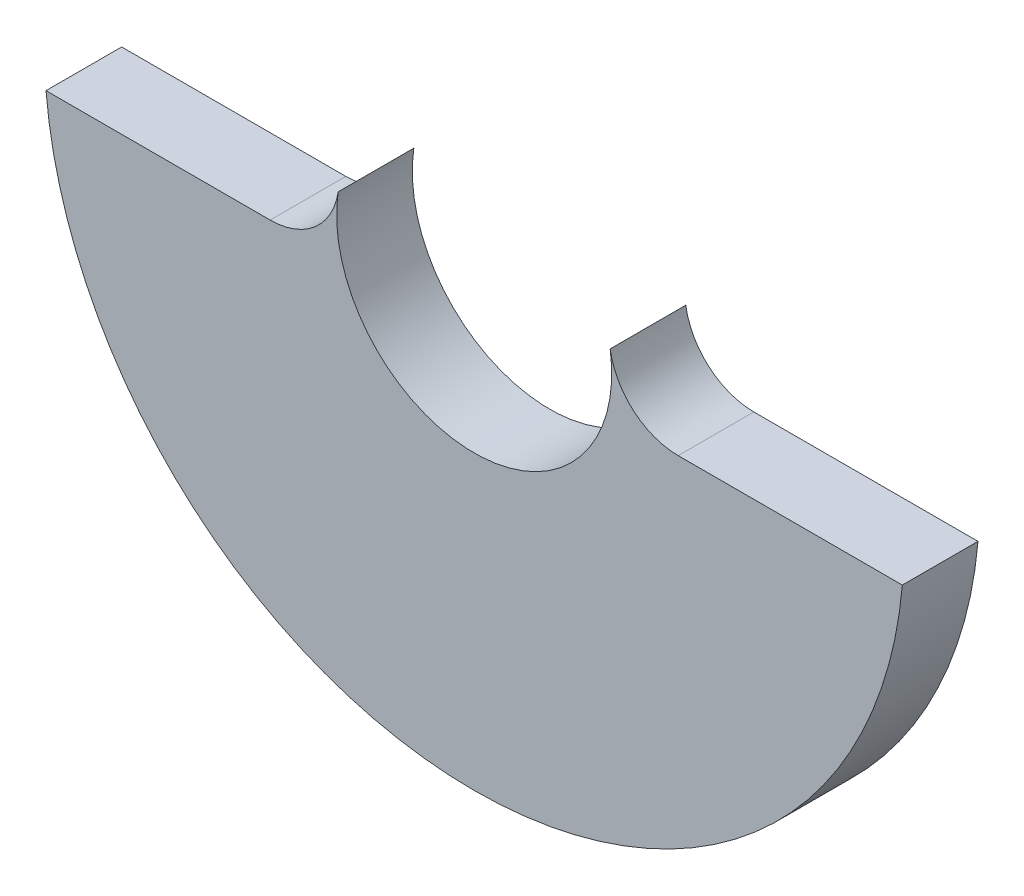
ISO-10303-21;
HEADER;
FILE_DESCRIPTION(('STEP AP214'),'2;1');
FILE_NAME('part.step','',(''),(''),'','','');
FILE_SCHEMA(('AUTOMOTIVE_DESIGN { 1 0 10303 214 1 1 1 1 }'));
ENDSEC;
DATA;
#1=APPLICATION_CONTEXT('core data for automotive mechanical design processes');
#2=APPLICATION_PROTOCOL_DEFINITION('international standard','automotive_design',2000,#1);
#3=PRODUCT_CONTEXT('',#1,'mechanical');
#4=PRODUCT('Part','Part','',(#3));
#5=PRODUCT_RELATED_PRODUCT_CATEGORY('part','',(#4));
#6=PRODUCT_DEFINITION_FORMATION('','',#4);
#7=PRODUCT_DEFINITION_CONTEXT('part definition',#1,'design');
#8=PRODUCT_DEFINITION('design','',#6,#7);
#9=PRODUCT_DEFINITION_SHAPE('','',#8);
#10=(LENGTH_UNIT() NAMED_UNIT(*) SI_UNIT(.MILLI.,.METRE.));
#11=(NAMED_UNIT(*) PLANE_ANGLE_UNIT() SI_UNIT($,.RADIAN.));
#12=(NAMED_UNIT(*) SI_UNIT($,.STERADIAN.) SOLID_ANGLE_UNIT());
#13=UNCERTAINTY_MEASURE_WITH_UNIT(LENGTH_MEASURE(1.E-05),#10,'distance_accuracy_value','');
#14=(GEOMETRIC_REPRESENTATION_CONTEXT(3) GLOBAL_UNCERTAINTY_ASSIGNED_CONTEXT((#13)) GLOBAL_UNIT_ASSIGNED_CONTEXT((#10,
#11,#12)) REPRESENTATION_CONTEXT('',''));
#15=CARTESIAN_POINT('',(0.,0.,0.));
#16=DIRECTION('',(0.,0.,1.));
#17=DIRECTION('',(1.,0.,0.));
#18=AXIS2_PLACEMENT_3D('',#15,#16,#17);
#19=CARTESIAN_POINT('',(-31.283198072784,-2.2,0.));
#20=DIRECTION('',(0.,-1.,0.));
#21=DIRECTION('',(0.,0.,-1.));
#22=AXIS2_PLACEMENT_3D('',#19,#20,#21);
#23=PLANE('',#22);
#24=DIRECTION('',(0.,0.,1.));
#25=VECTOR('',#24,1.);
#26=CARTESIAN_POINT('',(11.8642319599711,-2.2,0.));
#27=LINE('',#26,#25);
#28=CARTESIAN_POINT('',(11.8642319599711,-2.2,0.));
#29=VERTEX_POINT('',#28);
#30=CARTESIAN_POINT('',(11.8642319599711,-2.2,4.4));
#31=VERTEX_POINT('',#30);
#32=EDGE_CURVE('E84',#29,#31,#27,.T.);
#33=ORIENTED_EDGE('',*,*,#32,.T.);
#34=DIRECTION('',(1.,0.,0.));
#35=VECTOR('',#34,1.);
#36=CARTESIAN_POINT('',(-31.283198072784,-2.2,4.4));
#37=LINE('',#36,#35);
#38=CARTESIAN_POINT('',(24.9030118660374,-2.2,4.4));
#39=VERTEX_POINT('',#38);
#40=EDGE_CURVE('E75',#31,#39,#37,.T.);
#41=ORIENTED_EDGE('',*,*,#40,.T.);
#42=DIRECTION('',(0.,0.,-1.));
#43=VECTOR('',#42,1.);
#44=CARTESIAN_POINT('',(24.9030118660374,-2.2,4.4));
#45=LINE('',#44,#43);
#46=CARTESIAN_POINT('',(24.9030118660374,-2.2,0.));
#47=VERTEX_POINT('',#46);
#48=EDGE_CURVE('E110',#47,#39,#45,.F.);
#49=ORIENTED_EDGE('',*,*,#48,.F.);
#50=DIRECTION('',(1.,0.,0.));
#51=VECTOR('',#50,1.);
#52=CARTESIAN_POINT('',(-31.283198072784,-2.2,0.));
#53=LINE('',#52,#51);
#54=EDGE_CURVE('E37',#29,#47,#53,.T.);
#55=ORIENTED_EDGE('',*,*,#54,.F.);
#56=EDGE_LOOP('',(#33,#41,#49,#55));
#57=FACE_BOUND('',#56,.T.);
#58=ADVANCED_FACE('F22',(#57),#23,.F.);
#59=CARTESIAN_POINT('',(0.,0.,4.4));
#60=DIRECTION('',(0.,0.,1.));
#61=DIRECTION('',(1.,0.,0.));
#62=AXIS2_PLACEMENT_3D('',#59,#60,#61);
#63=PLANE('',#62);
#64=CARTESIAN_POINT('',(-24.9030118660374,-2.2,4.4));
#65=VERTEX_POINT('',#64);
#66=CARTESIAN_POINT('',(-11.8642319599711,-2.2,4.4));
#67=VERTEX_POINT('',#66);
#68=EDGE_CURVE('E82',#65,#67,#37,.T.);
#69=ORIENTED_EDGE('',*,*,#68,.F.);
#70=CARTESIAN_POINT('',(0.,0.,4.4));
#71=DIRECTION('',(0.,0.,1.));
#72=DIRECTION('',(1.,0.,0.));
#73=AXIS2_PLACEMENT_3D('',#70,#71,#72);
#74=CIRCLE('',#73,25.);
#75=EDGE_CURVE('E11',#65,#39,#74,.T.);
#76=ORIENTED_EDGE('',*,*,#75,.T.);
#77=ORIENTED_EDGE('',*,*,#40,.F.);
#78=CARTESIAN_POINT('',(11.8642319599711,1.8,4.4));
#79=DIRECTION('',(0.,0.,-1.));
#80=DIRECTION('',(1.,0.,0.));
#81=AXIS2_PLACEMENT_3D('',#78,#79,#80);
#82=CIRCLE('',#81,4.);
#83=CARTESIAN_POINT('',(7.90948797331408,1.2,4.4));
#84=VERTEX_POINT('',#83);
#85=EDGE_CURVE('E79',#31,#84,#82,.T.);
#86=ORIENTED_EDGE('',*,*,#85,.T.);
#87=CARTESIAN_POINT('',(0.,0.,4.4));
#88=DIRECTION('',(0.,0.,1.));
#89=DIRECTION('',(1.,0.,0.));
#90=AXIS2_PLACEMENT_3D('',#87,#88,#89);
#91=CIRCLE('',#90,8.);
#92=CARTESIAN_POINT('',(-7.90948797331408,1.2,4.4));
#93=VERTEX_POINT('',#92);
#94=EDGE_CURVE('E117',#93,#84,#91,.T.);
#95=ORIENTED_EDGE('',*,*,#94,.F.);
#96=CARTESIAN_POINT('',(-11.8642319599711,1.8,4.4));
#97=DIRECTION('',(0.,0.,-1.));
#98=DIRECTION('',(1.,0.,0.));
#99=AXIS2_PLACEMENT_3D('',#96,#97,#98);
#100=CIRCLE('',#99,4.);
#101=EDGE_CURVE('E97',#93,#67,#100,.T.);
#102=ORIENTED_EDGE('',*,*,#101,.T.);
#103=EDGE_LOOP('',(#69,#76,#77,#86,#95,#102));
#104=FACE_BOUND('',#103,.T.);
#105=ADVANCED_FACE('F77',(#104),#63,.T.);
#106=CARTESIAN_POINT('',(0.,0.,0.));
#107=DIRECTION('',(0.,0.,1.));
#108=DIRECTION('',(1.,0.,0.));
#109=AXIS2_PLACEMENT_3D('',#106,#107,#108);
#110=PLANE('',#109);
#111=CARTESIAN_POINT('',(0.,0.,0.));
#112=DIRECTION('',(0.,0.,1.));
#113=DIRECTION('',(1.,0.,0.));
#114=AXIS2_PLACEMENT_3D('',#111,#112,#113);
#115=CIRCLE('',#114,25.);
#116=CARTESIAN_POINT('',(-24.9030118660374,-2.2,0.));
#117=VERTEX_POINT('',#116);
#118=EDGE_CURVE('E30',#117,#47,#115,.T.);
#119=ORIENTED_EDGE('',*,*,#118,.F.);
#120=CARTESIAN_POINT('',(-11.8642319599711,-2.2,0.));
#121=VERTEX_POINT('',#120);
#122=EDGE_CURVE('E109',#117,#121,#53,.T.);
#123=ORIENTED_EDGE('',*,*,#122,.T.);
#124=CARTESIAN_POINT('',(-11.8642319599711,1.8,0.));
#125=DIRECTION('',(0.,0.,-1.));
#126=DIRECTION('',(1.,0.,0.));
#127=AXIS2_PLACEMENT_3D('',#124,#125,#126);
#128=CIRCLE('',#127,4.);
#129=CARTESIAN_POINT('',(-7.90948797331408,1.2,0.));
#130=VERTEX_POINT('',#129);
#131=EDGE_CURVE('E101',#130,#121,#128,.T.);
#132=ORIENTED_EDGE('',*,*,#131,.F.);
#133=CARTESIAN_POINT('',(0.,0.,0.));
#134=DIRECTION('',(0.,0.,1.));
#135=DIRECTION('',(1.,0.,0.));
#136=AXIS2_PLACEMENT_3D('',#133,#134,#135);
#137=CIRCLE('',#136,8.);
#138=CARTESIAN_POINT('',(7.90948797331408,1.2,0.));
#139=VERTEX_POINT('',#138);
#140=EDGE_CURVE('E115',#130,#139,#137,.T.);
#141=ORIENTED_EDGE('',*,*,#140,.T.);
#142=CARTESIAN_POINT('',(11.8642319599711,1.8,0.));
#143=DIRECTION('',(0.,0.,-1.));
#144=DIRECTION('',(1.,0.,0.));
#145=AXIS2_PLACEMENT_3D('',#142,#143,#144);
#146=CIRCLE('',#145,4.);
#147=EDGE_CURVE('E89',#29,#139,#146,.T.);
#148=ORIENTED_EDGE('',*,*,#147,.F.);
#149=ORIENTED_EDGE('',*,*,#54,.T.);
#150=EDGE_LOOP('',(#119,#123,#132,#141,#148,#149));
#151=FACE_BOUND('',#150,.T.);
#152=ADVANCED_FACE('F122',(#151),#110,.F.);
#153=CARTESIAN_POINT('',(0.,0.,4.4));
#154=DIRECTION('',(0.,0.,-1.));
#155=DIRECTION('',(-1.,0.,0.));
#156=AXIS2_PLACEMENT_3D('',#153,#154,#155);
#157=CYLINDRICAL_SURFACE('',#156,25.);
#158=ORIENTED_EDGE('',*,*,#75,.F.);
#159=DIRECTION('',(0.,0.,-1.));
#160=VECTOR('',#159,1.);
#161=CARTESIAN_POINT('',(-24.9030118660374,-2.2,4.4));
#162=LINE('',#161,#160);
#163=EDGE_CURVE('E112',#65,#117,#162,.T.);
#164=ORIENTED_EDGE('',*,*,#163,.T.);
#165=ORIENTED_EDGE('',*,*,#118,.T.);
#166=ORIENTED_EDGE('',*,*,#48,.T.);
#167=EDGE_LOOP('',(#158,#164,#165,#166));
#168=FACE_BOUND('',#167,.T.);
#169=ADVANCED_FACE('F24',(#168),#157,.T.);
#170=CARTESIAN_POINT('',(0.,0.,4.4));
#171=DIRECTION('',(0.,0.,-1.));
#172=DIRECTION('',(-1.,0.,0.));
#173=AXIS2_PLACEMENT_3D('',#170,#171,#172);
#174=CYLINDRICAL_SURFACE('',#173,8.);
#175=ORIENTED_EDGE('',*,*,#140,.F.);
#176=DIRECTION('',(0.,0.,1.));
#177=VECTOR('',#176,1.);
#178=CARTESIAN_POINT('',(-7.90948797331408,1.2,0.));
#179=LINE('',#178,#177);
#180=EDGE_CURVE('E104',#130,#93,#179,.T.);
#181=ORIENTED_EDGE('',*,*,#180,.T.);
#182=ORIENTED_EDGE('',*,*,#94,.T.);
#183=DIRECTION('',(0.,0.,1.));
#184=VECTOR('',#183,1.);
#185=CARTESIAN_POINT('',(7.90948797331408,1.2,0.));
#186=LINE('',#185,#184);
#187=EDGE_CURVE('E88',#139,#84,#186,.T.);
#188=ORIENTED_EDGE('',*,*,#187,.F.);
#189=EDGE_LOOP('',(#175,#181,#182,#188));
#190=FACE_BOUND('',#189,.T.);
#191=ADVANCED_FACE('F126',(#190),#174,.F.);
#192=ORIENTED_EDGE('',*,*,#68,.T.);
#193=DIRECTION('',(0.,0.,1.));
#194=VECTOR('',#193,1.);
#195=CARTESIAN_POINT('',(-11.8642319599711,-2.2,0.));
#196=LINE('',#195,#194);
#197=EDGE_CURVE('E45',#121,#67,#196,.T.);
#198=ORIENTED_EDGE('',*,*,#197,.F.);
#199=ORIENTED_EDGE('',*,*,#122,.F.);
#200=ORIENTED_EDGE('',*,*,#163,.F.);
#201=EDGE_LOOP('',(#192,#198,#199,#200));
#202=FACE_BOUND('',#201,.T.);
#203=ADVANCED_FACE('F131',(#202),#23,.F.);
#204=CARTESIAN_POINT('',(-11.8642319599711,1.8,0.));
#205=DIRECTION('',(0.,0.,1.));
#206=DIRECTION('',(1.,0.,0.));
#207=AXIS2_PLACEMENT_3D('',#204,#205,#206);
#208=CYLINDRICAL_SURFACE('',#207,4.);
#209=ORIENTED_EDGE('',*,*,#101,.F.);
#210=ORIENTED_EDGE('',*,*,#180,.F.);
#211=ORIENTED_EDGE('',*,*,#131,.T.);
#212=ORIENTED_EDGE('',*,*,#197,.T.);
#213=EDGE_LOOP('',(#209,#210,#211,#212));
#214=FACE_BOUND('',#213,.T.);
#215=ADVANCED_FACE('F129',(#214),#208,.F.);
#216=CARTESIAN_POINT('',(11.8642319599711,1.8,0.));
#217=DIRECTION('',(0.,0.,1.));
#218=DIRECTION('',(1.,0.,0.));
#219=AXIS2_PLACEMENT_3D('',#216,#217,#218);
#220=CYLINDRICAL_SURFACE('',#219,4.);
#221=ORIENTED_EDGE('',*,*,#85,.F.);
#222=ORIENTED_EDGE('',*,*,#32,.F.);
#223=ORIENTED_EDGE('',*,*,#147,.T.);
#224=ORIENTED_EDGE('',*,*,#187,.T.);
#225=EDGE_LOOP('',(#221,#222,#223,#224));
#226=FACE_BOUND('',#225,.T.);
#227=ADVANCED_FACE('F92',(#226),#220,.F.);
#228=CLOSED_SHELL('',(#58,#105,#152,#169,#191,#203,#215,#227));
#229=MANIFOLD_SOLID_BREP('B2',#228);
#230=ADVANCED_BREP_SHAPE_REPRESENTATION('',(#18,#229),#14);
#231=SHAPE_DEFINITION_REPRESENTATION(#9,#230);
ENDSEC;
END-ISO-10303-21;
